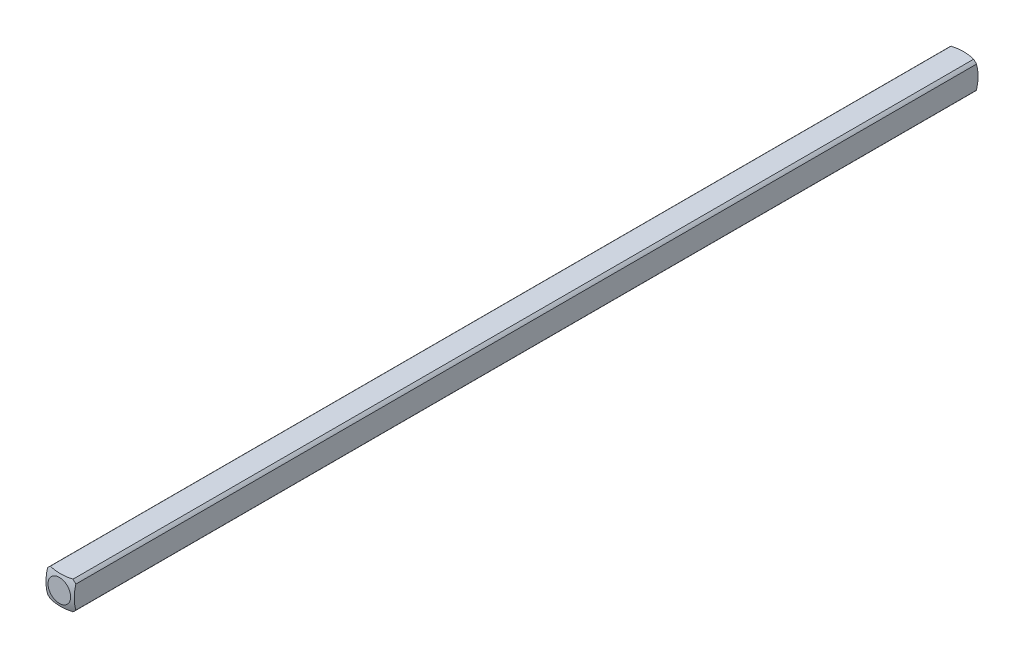
ISO-10303-21;
HEADER;
FILE_DESCRIPTION(('STEP AP214'),'2;1');
FILE_NAME('part.step','',(''),(''),'','','');
FILE_SCHEMA(('AUTOMOTIVE_DESIGN { 1 0 10303 214 1 1 1 1 }'));
ENDSEC;
DATA;
#1=APPLICATION_CONTEXT('core data for automotive mechanical design processes');
#2=APPLICATION_PROTOCOL_DEFINITION('international standard','automotive_design',2000,#1);
#3=PRODUCT_CONTEXT('',#1,'mechanical');
#4=PRODUCT('Part','Part','',(#3));
#5=PRODUCT_RELATED_PRODUCT_CATEGORY('part','',(#4));
#6=PRODUCT_DEFINITION_FORMATION('','',#4);
#7=PRODUCT_DEFINITION_CONTEXT('part definition',#1,'design');
#8=PRODUCT_DEFINITION('design','',#6,#7);
#9=PRODUCT_DEFINITION_SHAPE('','',#8);
#10=(LENGTH_UNIT() NAMED_UNIT(*) SI_UNIT(.MILLI.,.METRE.));
#11=(NAMED_UNIT(*) PLANE_ANGLE_UNIT() SI_UNIT($,.RADIAN.));
#12=(NAMED_UNIT(*) SI_UNIT($,.STERADIAN.) SOLID_ANGLE_UNIT());
#13=UNCERTAINTY_MEASURE_WITH_UNIT(LENGTH_MEASURE(1.E-05),#10,'distance_accuracy_value','');
#14=(GEOMETRIC_REPRESENTATION_CONTEXT(3) GLOBAL_UNCERTAINTY_ASSIGNED_CONTEXT((#13)) GLOBAL_UNIT_ASSIGNED_CONTEXT((#10,
#11,#12)) REPRESENTATION_CONTEXT('',''));
#15=CARTESIAN_POINT('',(0.,0.,0.));
#16=DIRECTION('',(0.,0.,1.));
#17=DIRECTION('',(1.,0.,0.));
#18=AXIS2_PLACEMENT_3D('',#15,#16,#17);
#19=CARTESIAN_POINT('',(-1.5875,-1.5875,50.8));
#20=DIRECTION('',(1.,0.,0.));
#21=DIRECTION('',(0.,0.,-1.));
#22=AXIS2_PLACEMENT_3D('',#19,#20,#21);
#23=PLANE('',#22);
#24=CARTESIAN_POINT('',(-1.5875,0.,4.91912226376204));
#25=DIRECTION('',(1.,0.,0.));
#26=DIRECTION('',(0.,0.,-1.));
#27=AXIS2_PLACEMENT_3D('',#24,#25,#26);
#28=CIRCLE('',#27,4.82558221875869);
#29=CARTESIAN_POINT('',(-1.5875,-1.26841150657032,0.263225357686904));
#30=VERTEX_POINT('',#29);
#31=CARTESIAN_POINT('',(-1.5875,1.26841150657032,0.263225357686907));
#32=VERTEX_POINT('',#31);
#33=EDGE_CURVE('E55',#30,#32,#28,.T.);
#34=ORIENTED_EDGE('',*,*,#33,.F.);
#35=DIRECTION('',(0.,0.,-1.));
#36=VECTOR('',#35,1.);
#37=CARTESIAN_POINT('',(-1.5875,-1.26841150657032,50.8));
#38=LINE('',#37,#36);
#39=CARTESIAN_POINT('',(-1.5875,-1.26841150657032,101.336774642313));
#40=VERTEX_POINT('',#39);
#41=EDGE_CURVE('E48',#40,#30,#38,.T.);
#42=ORIENTED_EDGE('',*,*,#41,.F.);
#43=CARTESIAN_POINT('',(-1.5875,0.,96.680877736238));
#44=DIRECTION('',(-1.,0.,0.));
#45=DIRECTION('',(0.,0.,1.));
#46=AXIS2_PLACEMENT_3D('',#43,#44,#45);
#47=CIRCLE('',#46,4.82558221875869);
#48=CARTESIAN_POINT('',(-1.5875,1.26841150657032,101.336774642313));
#49=VERTEX_POINT('',#48);
#50=EDGE_CURVE('E134',#40,#49,#47,.T.);
#51=ORIENTED_EDGE('',*,*,#50,.T.);
#52=DIRECTION('',(0.,0.,-1.));
#53=VECTOR('',#52,1.);
#54=CARTESIAN_POINT('',(-1.5875,1.26841150657032,50.8));
#55=LINE('',#54,#53);
#56=EDGE_CURVE('E120',#32,#49,#55,.F.);
#57=ORIENTED_EDGE('',*,*,#56,.F.);
#58=EDGE_LOOP('',(#34,#42,#51,#57));
#59=FACE_BOUND('',#58,.T.);
#60=ADVANCED_FACE('F40',(#59),#23,.F.);
#61=CARTESIAN_POINT('',(-1.5875,-1.5875,50.8));
#62=DIRECTION('',(0.,1.,0.));
#63=DIRECTION('',(0.,0.,1.));
#64=AXIS2_PLACEMENT_3D('',#61,#62,#63);
#65=PLANE('',#64);
#66=CARTESIAN_POINT('',(0.,-1.5875,4.91912226376204));
#67=DIRECTION('',(0.,1.,0.));
#68=DIRECTION('',(0.,0.,1.));
#69=AXIS2_PLACEMENT_3D('',#66,#67,#68);
#70=CIRCLE('',#69,4.82558221875869);
#71=CARTESIAN_POINT('',(1.26841150657032,-1.5875,0.263225357686905));
#72=VERTEX_POINT('',#71);
#73=CARTESIAN_POINT('',(-1.26841150657032,-1.5875,0.263225357686904));
#74=VERTEX_POINT('',#73);
#75=EDGE_CURVE('E175',#72,#74,#70,.T.);
#76=ORIENTED_EDGE('',*,*,#75,.F.);
#77=DIRECTION('',(0.,0.,-1.));
#78=VECTOR('',#77,1.);
#79=CARTESIAN_POINT('',(1.26841150657032,-1.5875,50.8));
#80=LINE('',#79,#78);
#81=CARTESIAN_POINT('',(1.26841150657032,-1.5875,101.336774642313));
#82=VERTEX_POINT('',#81);
#83=EDGE_CURVE('E195',#82,#72,#80,.T.);
#84=ORIENTED_EDGE('',*,*,#83,.F.);
#85=CARTESIAN_POINT('',(0.,-1.5875,96.680877736238));
#86=DIRECTION('',(0.,-1.,0.));
#87=DIRECTION('',(0.,0.,-1.));
#88=AXIS2_PLACEMENT_3D('',#85,#86,#87);
#89=CIRCLE('',#88,4.82558221875869);
#90=CARTESIAN_POINT('',(-1.26841150657032,-1.5875,101.336774642313));
#91=VERTEX_POINT('',#90);
#92=EDGE_CURVE('E149',#82,#91,#89,.T.);
#93=ORIENTED_EDGE('',*,*,#92,.T.);
#94=DIRECTION('',(0.,0.,-1.));
#95=VECTOR('',#94,1.);
#96=CARTESIAN_POINT('',(-1.26841150657032,-1.5875,50.8));
#97=LINE('',#96,#95);
#98=EDGE_CURVE('E192',#74,#91,#97,.F.);
#99=ORIENTED_EDGE('',*,*,#98,.F.);
#100=EDGE_LOOP('',(#76,#84,#93,#99));
#101=FACE_BOUND('',#100,.T.);
#102=ADVANCED_FACE('F208',(#101),#65,.F.);
#103=CARTESIAN_POINT('',(1.5875,-1.5875,50.8));
#104=DIRECTION('',(-1.,0.,0.));
#105=DIRECTION('',(0.,0.,1.));
#106=AXIS2_PLACEMENT_3D('',#103,#104,#105);
#107=PLANE('',#106);
#108=CARTESIAN_POINT('',(1.5875,0.,4.91912226376204));
#109=DIRECTION('',(-1.,0.,0.));
#110=DIRECTION('',(0.,0.,1.));
#111=AXIS2_PLACEMENT_3D('',#108,#109,#110);
#112=CIRCLE('',#111,4.82558221875869);
#113=CARTESIAN_POINT('',(1.5875,1.26841150657032,0.263225357686904));
#114=VERTEX_POINT('',#113);
#115=CARTESIAN_POINT('',(1.5875,-1.26841150657032,0.263225357686904));
#116=VERTEX_POINT('',#115);
#117=EDGE_CURVE('E172',#114,#116,#112,.T.);
#118=ORIENTED_EDGE('',*,*,#117,.F.);
#119=DIRECTION('',(0.,0.,-1.));
#120=VECTOR('',#119,1.);
#121=CARTESIAN_POINT('',(1.5875,1.26841150657032,50.8));
#122=LINE('',#121,#120);
#123=CARTESIAN_POINT('',(1.5875,1.26841150657032,101.336774642313));
#124=VERTEX_POINT('',#123);
#125=EDGE_CURVE('E188',#124,#114,#122,.T.);
#126=ORIENTED_EDGE('',*,*,#125,.F.);
#127=CARTESIAN_POINT('',(1.5875,0.,96.680877736238));
#128=DIRECTION('',(1.,0.,0.));
#129=DIRECTION('',(0.,0.,-1.));
#130=AXIS2_PLACEMENT_3D('',#127,#128,#129);
#131=CIRCLE('',#130,4.82558221875869);
#132=CARTESIAN_POINT('',(1.5875,-1.26841150657032,101.336774642313));
#133=VERTEX_POINT('',#132);
#134=EDGE_CURVE('E145',#124,#133,#131,.T.);
#135=ORIENTED_EDGE('',*,*,#134,.T.);
#136=DIRECTION('',(0.,0.,-1.));
#137=VECTOR('',#136,1.);
#138=CARTESIAN_POINT('',(1.5875,-1.26841150657032,50.8));
#139=LINE('',#138,#137);
#140=EDGE_CURVE('E113',#116,#133,#139,.F.);
#141=ORIENTED_EDGE('',*,*,#140,.F.);
#142=EDGE_LOOP('',(#118,#126,#135,#141));
#143=FACE_BOUND('',#142,.T.);
#144=ADVANCED_FACE('F215',(#143),#107,.F.);
#145=CARTESIAN_POINT('',(-1.5875,1.5875,50.8));
#146=DIRECTION('',(0.,-1.,0.));
#147=DIRECTION('',(0.,0.,-1.));
#148=AXIS2_PLACEMENT_3D('',#145,#146,#147);
#149=PLANE('',#148);
#150=CARTESIAN_POINT('',(0.,1.5875,4.91912226376204));
#151=DIRECTION('',(0.,-1.,0.));
#152=DIRECTION('',(0.,0.,-1.));
#153=AXIS2_PLACEMENT_3D('',#150,#151,#152);
#154=CIRCLE('',#153,4.82558221875869);
#155=CARTESIAN_POINT('',(-1.26841150657032,1.5875,0.263225357686904));
#156=VERTEX_POINT('',#155);
#157=CARTESIAN_POINT('',(1.26841150657032,1.5875,0.263225357686904));
#158=VERTEX_POINT('',#157);
#159=EDGE_CURVE('E110',#156,#158,#154,.T.);
#160=ORIENTED_EDGE('',*,*,#159,.F.);
#161=DIRECTION('',(0.,0.,-1.));
#162=VECTOR('',#161,1.);
#163=CARTESIAN_POINT('',(-1.26841150657032,1.5875,50.8));
#164=LINE('',#163,#162);
#165=CARTESIAN_POINT('',(-1.26841150657032,1.5875,101.336774642313));
#166=VERTEX_POINT('',#165);
#167=EDGE_CURVE('E104',#166,#156,#164,.T.);
#168=ORIENTED_EDGE('',*,*,#167,.F.);
#169=CARTESIAN_POINT('',(0.,1.5875,96.680877736238));
#170=DIRECTION('',(0.,1.,0.));
#171=DIRECTION('',(0.,0.,1.));
#172=AXIS2_PLACEMENT_3D('',#169,#170,#171);
#173=CIRCLE('',#172,4.82558221875869);
#174=CARTESIAN_POINT('',(1.26841150657032,1.5875,101.336774642313));
#175=VERTEX_POINT('',#174);
#176=EDGE_CURVE('E109',#166,#175,#173,.T.);
#177=ORIENTED_EDGE('',*,*,#176,.T.);
#178=DIRECTION('',(0.,0.,-1.));
#179=VECTOR('',#178,1.);
#180=CARTESIAN_POINT('',(1.26841150657032,1.5875,50.8));
#181=LINE('',#180,#179);
#182=EDGE_CURVE('E114',#158,#175,#181,.F.);
#183=ORIENTED_EDGE('',*,*,#182,.F.);
#184=EDGE_LOOP('',(#160,#168,#177,#183));
#185=FACE_BOUND('',#184,.T.);
#186=ADVANCED_FACE('F106',(#185),#149,.F.);
#187=CARTESIAN_POINT('',(0.,0.,50.8));
#188=DIRECTION('',(0.,0.,-1.));
#189=DIRECTION('',(-1.,0.,0.));
#190=AXIS2_PLACEMENT_3D('',#187,#188,#189);
#191=CYLINDRICAL_SURFACE('',#190,2.032);
#192=ORIENTED_EDGE('',*,*,#41,.T.);
#193=CARTESIAN_POINT('',(0.,0.,0.263225357686904));
#194=DIRECTION('',(0.,0.,1.));
#195=DIRECTION('',(1.,0.,0.));
#196=AXIS2_PLACEMENT_3D('',#193,#194,#195);
#197=CIRCLE('',#196,2.032);
#198=EDGE_CURVE('E168',#30,#74,#197,.T.);
#199=ORIENTED_EDGE('',*,*,#198,.T.);
#200=ORIENTED_EDGE('',*,*,#98,.T.);
#201=CARTESIAN_POINT('',(0.,0.,101.336774642313));
#202=DIRECTION('',(0.,0.,1.));
#203=DIRECTION('',(1.,0.,0.));
#204=AXIS2_PLACEMENT_3D('',#201,#202,#203);
#205=CIRCLE('',#204,2.032);
#206=EDGE_CURVE('E141',#40,#91,#205,.T.);
#207=ORIENTED_EDGE('',*,*,#206,.F.);
#208=EDGE_LOOP('',(#192,#199,#200,#207));
#209=FACE_BOUND('',#208,.T.);
#210=ADVANCED_FACE('F204',(#209),#191,.T.);
#211=ORIENTED_EDGE('',*,*,#83,.T.);
#212=CARTESIAN_POINT('',(0.,0.,0.263225357686904));
#213=DIRECTION('',(0.,0.,1.));
#214=DIRECTION('',(1.,0.,0.));
#215=AXIS2_PLACEMENT_3D('',#212,#213,#214);
#216=CIRCLE('',#215,2.032);
#217=EDGE_CURVE('E61',#72,#116,#216,.T.);
#218=ORIENTED_EDGE('',*,*,#217,.T.);
#219=ORIENTED_EDGE('',*,*,#140,.T.);
#220=CARTESIAN_POINT('',(0.,0.,101.336774642313));
#221=DIRECTION('',(0.,0.,1.));
#222=DIRECTION('',(1.,0.,0.));
#223=AXIS2_PLACEMENT_3D('',#220,#221,#222);
#224=CIRCLE('',#223,2.032);
#225=EDGE_CURVE('E153',#82,#133,#224,.T.);
#226=ORIENTED_EDGE('',*,*,#225,.F.);
#227=EDGE_LOOP('',(#211,#218,#219,#226));
#228=FACE_BOUND('',#227,.T.);
#229=ADVANCED_FACE('F211',(#228),#191,.T.);
#230=ORIENTED_EDGE('',*,*,#125,.T.);
#231=CARTESIAN_POINT('',(0.,0.,0.263225357686904));
#232=DIRECTION('',(0.,0.,1.));
#233=DIRECTION('',(1.,0.,0.));
#234=AXIS2_PLACEMENT_3D('',#231,#232,#233);
#235=CIRCLE('',#234,2.032);
#236=EDGE_CURVE('E164',#114,#158,#235,.T.);
#237=ORIENTED_EDGE('',*,*,#236,.T.);
#238=ORIENTED_EDGE('',*,*,#182,.T.);
#239=CARTESIAN_POINT('',(0.,0.,101.336774642313));
#240=DIRECTION('',(0.,0.,1.));
#241=DIRECTION('',(1.,0.,0.));
#242=AXIS2_PLACEMENT_3D('',#239,#240,#241);
#243=CIRCLE('',#242,2.032);
#244=EDGE_CURVE('E132',#124,#175,#243,.T.);
#245=ORIENTED_EDGE('',*,*,#244,.F.);
#246=EDGE_LOOP('',(#230,#237,#238,#245));
#247=FACE_BOUND('',#246,.T.);
#248=ADVANCED_FACE('F217',(#247),#191,.T.);
#249=ORIENTED_EDGE('',*,*,#167,.T.);
#250=CARTESIAN_POINT('',(0.,0.,0.263225357686904));
#251=DIRECTION('',(0.,0.,1.));
#252=DIRECTION('',(1.,0.,0.));
#253=AXIS2_PLACEMENT_3D('',#250,#251,#252);
#254=CIRCLE('',#253,2.032);
#255=EDGE_CURVE('E12',#156,#32,#254,.T.);
#256=ORIENTED_EDGE('',*,*,#255,.T.);
#257=ORIENTED_EDGE('',*,*,#56,.T.);
#258=CARTESIAN_POINT('',(0.,0.,101.336774642313));
#259=DIRECTION('',(0.,0.,1.));
#260=DIRECTION('',(1.,0.,0.));
#261=AXIS2_PLACEMENT_3D('',#258,#259,#260);
#262=CIRCLE('',#261,2.032);
#263=EDGE_CURVE('E117',#166,#49,#262,.T.);
#264=ORIENTED_EDGE('',*,*,#263,.F.);
#265=EDGE_LOOP('',(#249,#256,#257,#264));
#266=FACE_BOUND('',#265,.T.);
#267=ADVANCED_FACE('F118',(#266),#191,.T.);
#268=CARTESIAN_POINT('',(0.,0.,4.91912226376204));
#269=DIRECTION('',(0.,0.,1.));
#270=DIRECTION('',(-1.,0.,0.));
#271=AXIS2_PLACEMENT_3D('',#268,#269,#270);
#272=SPHERICAL_SURFACE('',#271,5.08);
#273=CARTESIAN_POINT('',(0.,0.,0.));
#274=DIRECTION('',(0.,0.,-1.));
#275=DIRECTION('',(-1.,0.,0.));
#276=AXIS2_PLACEMENT_3D('',#273,#274,#275);
#277=CIRCLE('',#276,1.26832020963187);
#278=CARTESIAN_POINT('',(-1.26832020963187,0.,0.));
#279=VERTEX_POINT('',#278);
#280=EDGE_CURVE('E180',#279,#279,#277,.T.);
#281=ORIENTED_EDGE('',*,*,#280,.F.);
#282=EDGE_LOOP('',(#281));
#283=FACE_BOUND('',#282,.T.);
#284=ORIENTED_EDGE('',*,*,#75,.T.);
#285=ORIENTED_EDGE('',*,*,#198,.F.);
#286=ORIENTED_EDGE('',*,*,#33,.T.);
#287=ORIENTED_EDGE('',*,*,#255,.F.);
#288=ORIENTED_EDGE('',*,*,#159,.T.);
#289=ORIENTED_EDGE('',*,*,#236,.F.);
#290=ORIENTED_EDGE('',*,*,#117,.T.);
#291=ORIENTED_EDGE('',*,*,#217,.F.);
#292=EDGE_LOOP('',(#284,#285,#286,#287,#288,#289,#290,#291));
#293=FACE_BOUND('',#292,.T.);
#294=ADVANCED_FACE('F218',(#283,#293),#272,.T.);
#295=CARTESIAN_POINT('',(0.,0.,0.));
#296=DIRECTION('',(0.,0.,-1.));
#297=DIRECTION('',(-1.,0.,0.));
#298=AXIS2_PLACEMENT_3D('',#295,#296,#297);
#299=PLANE('',#298);
#300=ORIENTED_EDGE('',*,*,#280,.T.);
#301=EDGE_LOOP('',(#300));
#302=FACE_BOUND('',#301,.T.);
#303=ADVANCED_FACE('F220',(#302),#299,.T.);
#304=CARTESIAN_POINT('',(0.,0.,96.680877736238));
#305=DIRECTION('',(0.,0.,-1.));
#306=DIRECTION('',(-1.,0.,0.));
#307=AXIS2_PLACEMENT_3D('',#304,#305,#306);
#308=SPHERICAL_SURFACE('',#307,5.08);
#309=CARTESIAN_POINT('',(0.,0.,101.6));
#310=DIRECTION('',(0.,0.,-1.));
#311=DIRECTION('',(-1.,0.,0.));
#312=AXIS2_PLACEMENT_3D('',#309,#310,#311);
#313=CIRCLE('',#312,1.26832020963187);
#314=CARTESIAN_POINT('',(-1.26832020963187,0.,101.6));
#315=VERTEX_POINT('',#314);
#316=EDGE_CURVE('E125',#315,#315,#313,.T.);
#317=ORIENTED_EDGE('',*,*,#316,.T.);
#318=EDGE_LOOP('',(#317));
#319=FACE_BOUND('',#318,.T.);
#320=ORIENTED_EDGE('',*,*,#92,.F.);
#321=ORIENTED_EDGE('',*,*,#225,.T.);
#322=ORIENTED_EDGE('',*,*,#134,.F.);
#323=ORIENTED_EDGE('',*,*,#244,.T.);
#324=ORIENTED_EDGE('',*,*,#176,.F.);
#325=ORIENTED_EDGE('',*,*,#263,.T.);
#326=ORIENTED_EDGE('',*,*,#50,.F.);
#327=ORIENTED_EDGE('',*,*,#206,.T.);
#328=EDGE_LOOP('',(#320,#321,#322,#323,#324,#325,#326,#327));
#329=FACE_BOUND('',#328,.T.);
#330=ADVANCED_FACE('F129',(#319,#329),#308,.T.);
#331=CARTESIAN_POINT('',(0.,0.,101.6));
#332=DIRECTION('',(0.,0.,1.));
#333=DIRECTION('',(-1.,0.,0.));
#334=AXIS2_PLACEMENT_3D('',#331,#332,#333);
#335=PLANE('',#334);
#336=ORIENTED_EDGE('',*,*,#316,.F.);
#337=EDGE_LOOP('',(#336));
#338=FACE_BOUND('',#337,.T.);
#339=ADVANCED_FACE('F265',(#338),#335,.T.);
#340=CLOSED_SHELL('',(#60,#102,#144,#186,#210,#229,#248,#267,#294,#303,#330,#339));
#341=MANIFOLD_SOLID_BREP('B2',#340);
#342=ADVANCED_BREP_SHAPE_REPRESENTATION('',(#18,#341),#14);
#343=SHAPE_DEFINITION_REPRESENTATION(#9,#342);
ENDSEC;
END-ISO-10303-21;
